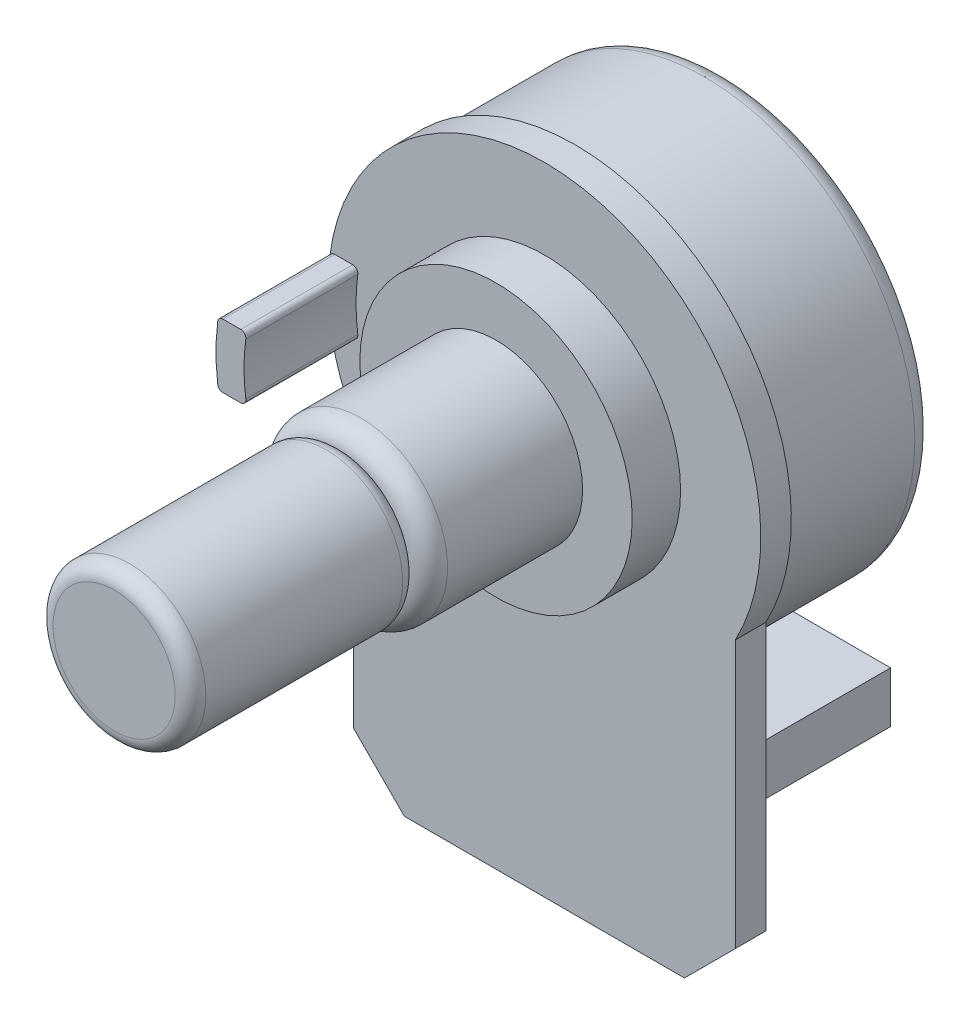
ISO-10303-21;
HEADER;
FILE_DESCRIPTION(('STEP AP214'),'2;1');
FILE_NAME('part.step','',(''),(''),'','','');
FILE_SCHEMA(('AUTOMOTIVE_DESIGN { 1 0 10303 214 1 1 1 1 }'));
ENDSEC;
DATA;
#1=APPLICATION_CONTEXT('core data for automotive mechanical design processes');
#2=APPLICATION_PROTOCOL_DEFINITION('international standard','automotive_design',2000,#1);
#3=PRODUCT_CONTEXT('',#1,'mechanical');
#4=PRODUCT('Part','Part','',(#3));
#5=PRODUCT_RELATED_PRODUCT_CATEGORY('part','',(#4));
#6=PRODUCT_DEFINITION_FORMATION('','',#4);
#7=PRODUCT_DEFINITION_CONTEXT('part definition',#1,'design');
#8=PRODUCT_DEFINITION('design','',#6,#7);
#9=PRODUCT_DEFINITION_SHAPE('','',#8);
#10=(LENGTH_UNIT() NAMED_UNIT(*) SI_UNIT(.MILLI.,.METRE.));
#11=(NAMED_UNIT(*) PLANE_ANGLE_UNIT() SI_UNIT($,.RADIAN.));
#12=(NAMED_UNIT(*) SI_UNIT($,.STERADIAN.) SOLID_ANGLE_UNIT());
#13=UNCERTAINTY_MEASURE_WITH_UNIT(LENGTH_MEASURE(1.E-05),#10,'distance_accuracy_value','');
#14=(GEOMETRIC_REPRESENTATION_CONTEXT(3) GLOBAL_UNCERTAINTY_ASSIGNED_CONTEXT((#13)) GLOBAL_UNIT_ASSIGNED_CONTEXT((#10,
#11,#12)) REPRESENTATION_CONTEXT('',''));
#15=CARTESIAN_POINT('',(0.,0.,0.));
#16=DIRECTION('',(0.,0.,1.));
#17=DIRECTION('',(1.,0.,0.));
#18=AXIS2_PLACEMENT_3D('',#15,#16,#17);
#19=CARTESIAN_POINT('',(0.,0.,1.2));
#20=DIRECTION('',(0.,0.,1.));
#21=DIRECTION('',(1.,0.,0.));
#22=AXIS2_PLACEMENT_3D('',#19,#20,#21);
#23=PLANE('',#22);
#24=CARTESIAN_POINT('',(0.,0.,1.2));
#25=DIRECTION('',(0.,0.,1.));
#26=DIRECTION('',(1.,0.,0.));
#27=AXIS2_PLACEMENT_3D('',#24,#25,#26);
#28=CIRCLE('',#27,5.35);
#29=CARTESIAN_POINT('',(-5.35,0.,1.2));
#30=VERTEX_POINT('',#29);
#31=EDGE_CURVE('E214',#30,#30,#28,.T.);
#32=ORIENTED_EDGE('',*,*,#31,.F.);
#33=EDGE_LOOP('',(#32));
#34=FACE_BOUND('',#33,.T.);
#35=CARTESIAN_POINT('',(1.70002900645727E-13,0.,1.2));
#36=DIRECTION('',(0.,0.,-1.));
#37=DIRECTION('',(1.,0.,0.));
#38=AXIS2_PLACEMENT_3D('',#35,#36,#37);
#39=CIRCLE('',#38,7.40000000000017);
#40=CARTESIAN_POINT('',(-7.32903559901536,-1.02236842105263,1.2));
#41=VERTEX_POINT('',#40);
#42=CARTESIAN_POINT('',(-7.32903559901535,1.02236842105263,1.2));
#43=VERTEX_POINT('',#42);
#44=EDGE_CURVE('E431',#41,#43,#39,.T.);
#45=ORIENTED_EDGE('',*,*,#44,.F.);
#46=CARTESIAN_POINT('',(-7.52711764223199,-1.05,1.2));
#47=DIRECTION('',(0.,0.,1.));
#48=DIRECTION('',(1.,0.,0.));
#49=AXIS2_PLACEMENT_3D('',#46,#47,#48);
#50=CIRCLE('',#49,0.2);
#51=CARTESIAN_POINT('',(-7.52711764223199,-1.25,1.2));
#52=VERTEX_POINT('',#51);
#53=EDGE_CURVE('E12',#41,#52,#50,.F.);
#54=ORIENTED_EDGE('',*,*,#53,.T.);
#55=DIRECTION('',(1.,0.,0.));
#56=VECTOR('',#55,1.);
#57=CARTESIAN_POINT('',(-8.40758586040012,-1.25,1.2));
#58=LINE('',#57,#56);
#59=CARTESIAN_POINT('',(-8.23331646422024,-1.25,1.2));
#60=VERTEX_POINT('',#59);
#61=EDGE_CURVE('E315',#60,#52,#58,.T.);
#62=ORIENTED_EDGE('',*,*,#61,.F.);
#63=CARTESIAN_POINT('',(-8.23331646422024,-1.05,1.2));
#64=DIRECTION('',(0.,0.,1.));
#65=DIRECTION('',(1.,0.,0.));
#66=AXIS2_PLACEMENT_3D('',#63,#64,#65);
#67=CIRCLE('',#66,0.2);
#68=CARTESIAN_POINT('',(-8.43170963203277,-1.07530120481928,1.2));
#69=VERTEX_POINT('',#68);
#70=EDGE_CURVE('E43',#60,#69,#67,.F.);
#71=ORIENTED_EDGE('',*,*,#70,.T.);
#72=CARTESIAN_POINT('',(0.,0.,1.2));
#73=DIRECTION('',(0.,0.,1.));
#74=DIRECTION('',(1.,0.,0.));
#75=AXIS2_PLACEMENT_3D('',#72,#73,#74);
#76=CIRCLE('',#75,8.5);
#77=CARTESIAN_POINT('',(-7.5,-4.,1.2));
#78=VERTEX_POINT('',#77);
#79=EDGE_CURVE('E225',#69,#78,#76,.T.);
#80=ORIENTED_EDGE('',*,*,#79,.T.);
#81=DIRECTION('',(0.,-1.,0.));
#82=VECTOR('',#81,1.);
#83=CARTESIAN_POINT('',(-7.5,-16.5,1.2));
#84=LINE('',#83,#82);
#85=CARTESIAN_POINT('',(-7.5,-14.5,1.2));
#86=VERTEX_POINT('',#85);
#87=EDGE_CURVE('E224',#78,#86,#84,.T.);
#88=ORIENTED_EDGE('',*,*,#87,.T.);
#89=DIRECTION('',(-0.707106781186547,0.707106781186548,0.));
#90=VECTOR('',#89,1.);
#91=CARTESIAN_POINT('',(-11.,-11.,1.2));
#92=LINE('',#91,#90);
#93=CARTESIAN_POINT('',(-5.5,-16.5,1.2));
#94=VERTEX_POINT('',#93);
#95=EDGE_CURVE('E278',#86,#94,#92,.F.);
#96=ORIENTED_EDGE('',*,*,#95,.T.);
#97=DIRECTION('',(1.,0.,0.));
#98=VECTOR('',#97,1.);
#99=CARTESIAN_POINT('',(7.5,-16.5,1.2));
#100=LINE('',#99,#98);
#101=CARTESIAN_POINT('',(5.49999999999999,-16.5,1.2));
#102=VERTEX_POINT('',#101);
#103=EDGE_CURVE('E228',#94,#102,#100,.T.);
#104=ORIENTED_EDGE('',*,*,#103,.T.);
#105=DIRECTION('',(-0.707106781186548,-0.707106781186547,0.));
#106=VECTOR('',#105,1.);
#107=CARTESIAN_POINT('',(11.,-11.,1.2));
#108=LINE('',#107,#106);
#109=CARTESIAN_POINT('',(7.5,-14.5,1.2));
#110=VERTEX_POINT('',#109);
#111=EDGE_CURVE('E280',#102,#110,#108,.F.);
#112=ORIENTED_EDGE('',*,*,#111,.T.);
#113=DIRECTION('',(0.,1.,0.));
#114=VECTOR('',#113,1.);
#115=CARTESIAN_POINT('',(7.5,-4.,1.2));
#116=LINE('',#115,#114);
#117=CARTESIAN_POINT('',(7.5,-4.,1.2));
#118=VERTEX_POINT('',#117);
#119=EDGE_CURVE('E231',#110,#118,#116,.T.);
#120=ORIENTED_EDGE('',*,*,#119,.T.);
#121=CARTESIAN_POINT('',(-8.43170963203277,1.07530120481928,1.2));
#122=VERTEX_POINT('',#121);
#123=EDGE_CURVE('E222',#118,#122,#76,.T.);
#124=ORIENTED_EDGE('',*,*,#123,.T.);
#125=CARTESIAN_POINT('',(-8.23331646422024,1.05,1.2));
#126=DIRECTION('',(0.,0.,1.));
#127=DIRECTION('',(1.,0.,0.));
#128=AXIS2_PLACEMENT_3D('',#125,#126,#127);
#129=CIRCLE('',#128,0.2);
#130=CARTESIAN_POINT('',(-8.23331646422024,1.25,1.2));
#131=VERTEX_POINT('',#130);
#132=EDGE_CURVE('E313',#122,#131,#129,.F.);
#133=ORIENTED_EDGE('',*,*,#132,.T.);
#134=DIRECTION('',(-1.,0.,0.));
#135=VECTOR('',#134,1.);
#136=CARTESIAN_POINT('',(-8.40758586040012,1.25,1.2));
#137=LINE('',#136,#135);
#138=CARTESIAN_POINT('',(-7.52711764223198,1.25,1.2));
#139=VERTEX_POINT('',#138);
#140=EDGE_CURVE('E334',#139,#131,#137,.T.);
#141=ORIENTED_EDGE('',*,*,#140,.F.);
#142=CARTESIAN_POINT('',(-7.52711764223198,1.05,1.2));
#143=DIRECTION('',(0.,0.,1.));
#144=DIRECTION('',(1.,0.,0.));
#145=AXIS2_PLACEMENT_3D('',#142,#143,#144);
#146=CIRCLE('',#145,0.2);
#147=EDGE_CURVE('E311',#139,#43,#146,.F.);
#148=ORIENTED_EDGE('',*,*,#147,.T.);
#149=EDGE_LOOP('',(#45,#54,#62,#71,#80,#88,#96,#104,#112,#120,#124,#133,#141,#148));
#150=FACE_BOUND('',#149,.T.);
#151=ADVANCED_FACE('F35',(#34,#150),#23,.T.);
#152=CARTESIAN_POINT('',(0.,0.,0.));
#153=DIRECTION('',(0.,0.,1.));
#154=DIRECTION('',(1.,0.,0.));
#155=AXIS2_PLACEMENT_3D('',#152,#153,#154);
#156=PLANE('',#155);
#157=DIRECTION('',(0.,1.,0.));
#158=VECTOR('',#157,1.);
#159=CARTESIAN_POINT('',(7.5,-4.,0.));
#160=LINE('',#159,#158);
#161=CARTESIAN_POINT('',(7.5,-14.5,0.));
#162=VERTEX_POINT('',#161);
#163=CARTESIAN_POINT('',(7.5,-4.,0.));
#164=VERTEX_POINT('',#163);
#165=EDGE_CURVE('E242',#162,#164,#160,.T.);
#166=ORIENTED_EDGE('',*,*,#165,.F.);
#167=DIRECTION('',(0.707106781186548,0.707106781186547,0.));
#168=VECTOR('',#167,1.);
#169=CARTESIAN_POINT('',(7.5,-14.5,0.));
#170=LINE('',#169,#168);
#171=CARTESIAN_POINT('',(5.49999999999999,-16.5,0.));
#172=VERTEX_POINT('',#171);
#173=EDGE_CURVE('E271',#162,#172,#170,.F.);
#174=ORIENTED_EDGE('',*,*,#173,.T.);
#175=DIRECTION('',(1.,0.,0.));
#176=VECTOR('',#175,1.);
#177=CARTESIAN_POINT('',(7.5,-16.5,0.));
#178=LINE('',#177,#176);
#179=CARTESIAN_POINT('',(-5.5,-16.5,0.));
#180=VERTEX_POINT('',#179);
#181=EDGE_CURVE('E239',#180,#172,#178,.T.);
#182=ORIENTED_EDGE('',*,*,#181,.F.);
#183=DIRECTION('',(0.707106781186547,-0.707106781186548,0.));
#184=VECTOR('',#183,1.);
#185=CARTESIAN_POINT('',(-5.5,-16.5,0.));
#186=LINE('',#185,#184);
#187=CARTESIAN_POINT('',(-7.5,-14.5,0.));
#188=VERTEX_POINT('',#187);
#189=EDGE_CURVE('E269',#180,#188,#186,.F.);
#190=ORIENTED_EDGE('',*,*,#189,.T.);
#191=DIRECTION('',(0.,-1.,0.));
#192=VECTOR('',#191,1.);
#193=CARTESIAN_POINT('',(-7.5,-16.5,0.));
#194=LINE('',#193,#192);
#195=CARTESIAN_POINT('',(-7.5,-4.,0.));
#196=VERTEX_POINT('',#195);
#197=EDGE_CURVE('E236',#196,#188,#194,.T.);
#198=ORIENTED_EDGE('',*,*,#197,.F.);
#199=CARTESIAN_POINT('',(0.,0.,0.));
#200=DIRECTION('',(0.,0.,1.));
#201=DIRECTION('',(1.,0.,0.));
#202=AXIS2_PLACEMENT_3D('',#199,#200,#201);
#203=CIRCLE('',#202,8.5);
#204=EDGE_CURVE('E218',#164,#196,#203,.T.);
#205=ORIENTED_EDGE('',*,*,#204,.F.);
#206=EDGE_LOOP('',(#166,#174,#182,#190,#198,#205));
#207=FACE_BOUND('',#206,.T.);
#208=CARTESIAN_POINT('',(0.,0.,0.));
#209=DIRECTION('',(0.,0.,-1.));
#210=DIRECTION('',(-1.,0.,0.));
#211=AXIS2_PLACEMENT_3D('',#208,#209,#210);
#212=CIRCLE('',#211,8.25);
#213=CARTESIAN_POINT('',(-8.25,0.,0.));
#214=VERTEX_POINT('',#213);
#215=EDGE_CURVE('E205',#214,#214,#212,.T.);
#216=ORIENTED_EDGE('',*,*,#215,.F.);
#217=EDGE_LOOP('',(#216));
#218=FACE_BOUND('',#217,.T.);
#219=DIRECTION('',(1.,0.,0.));
#220=VECTOR('',#219,1.);
#221=CARTESIAN_POINT('',(6.49799227004166,-9.,0.));
#222=LINE('',#221,#220);
#223=CARTESIAN_POINT('',(-6.49799227004166,-9.,0.));
#224=VERTEX_POINT('',#223);
#225=CARTESIAN_POINT('',(6.49799227004166,-9.,0.));
#226=VERTEX_POINT('',#225);
#227=EDGE_CURVE('E195',#224,#226,#222,.T.);
#228=ORIENTED_EDGE('',*,*,#227,.F.);
#229=DIRECTION('',(0.,1.,0.));
#230=VECTOR('',#229,1.);
#231=CARTESIAN_POINT('',(-6.49799227004166,-9.,0.));
#232=LINE('',#231,#230);
#233=CARTESIAN_POINT('',(-6.49799227004166,-11.,0.));
#234=VERTEX_POINT('',#233);
#235=EDGE_CURVE('E166',#234,#224,#232,.T.);
#236=ORIENTED_EDGE('',*,*,#235,.F.);
#237=DIRECTION('',(-1.,0.,0.));
#238=VECTOR('',#237,1.);
#239=CARTESIAN_POINT('',(6.49799227004166,-11.,0.));
#240=LINE('',#239,#238);
#241=CARTESIAN_POINT('',(6.49799227004166,-11.,0.));
#242=VERTEX_POINT('',#241);
#243=EDGE_CURVE('E159',#242,#234,#240,.T.);
#244=ORIENTED_EDGE('',*,*,#243,.F.);
#245=DIRECTION('',(0.,-1.,0.));
#246=VECTOR('',#245,1.);
#247=CARTESIAN_POINT('',(6.49799227004166,-9.,0.));
#248=LINE('',#247,#246);
#249=EDGE_CURVE('E163',#226,#242,#248,.T.);
#250=ORIENTED_EDGE('',*,*,#249,.F.);
#251=EDGE_LOOP('',(#228,#236,#244,#250));
#252=FACE_BOUND('',#251,.T.);
#253=ADVANCED_FACE('F161',(#207,#218,#252),#156,.F.);
#254=CARTESIAN_POINT('',(0.,0.,1.2));
#255=DIRECTION('',(0.,0.,-1.));
#256=DIRECTION('',(-1.,0.,0.));
#257=AXIS2_PLACEMENT_3D('',#254,#255,#256);
#258=CYLINDRICAL_SURFACE('',#257,8.5);
#259=CARTESIAN_POINT('',(1.70002900645727E-13,0.,5.6));
#260=DIRECTION('',(0.,0.,1.));
#261=DIRECTION('',(1.,0.,0.));
#262=AXIS2_PLACEMENT_3D('',#259,#260,#261);
#263=CIRCLE('',#262,8.50000000000017);
#264=CARTESIAN_POINT('',(-8.43170963203277,1.07530120481928,5.6));
#265=VERTEX_POINT('',#264);
#266=CARTESIAN_POINT('',(-8.43170963203277,-1.07530120481928,5.6));
#267=VERTEX_POINT('',#266);
#268=EDGE_CURVE('E322',#265,#267,#263,.T.);
#269=ORIENTED_EDGE('',*,*,#268,.F.);
#270=DIRECTION('',(0.,0.,-1.));
#271=VECTOR('',#270,1.);
#272=CARTESIAN_POINT('',(-8.43170963203277,1.07530120481928,1.2));
#273=LINE('',#272,#271);
#274=EDGE_CURVE('E304',#265,#122,#273,.T.);
#275=ORIENTED_EDGE('',*,*,#274,.T.);
#276=ORIENTED_EDGE('',*,*,#123,.F.);
#277=DIRECTION('',(0.,0.,-1.));
#278=VECTOR('',#277,1.);
#279=CARTESIAN_POINT('',(7.5,-4.,1.2));
#280=LINE('',#279,#278);
#281=EDGE_CURVE('E233',#118,#164,#280,.T.);
#282=ORIENTED_EDGE('',*,*,#281,.T.);
#283=ORIENTED_EDGE('',*,*,#204,.T.);
#284=DIRECTION('',(0.,0.,-1.));
#285=VECTOR('',#284,1.);
#286=CARTESIAN_POINT('',(-7.5,-4.,1.2));
#287=LINE('',#286,#285);
#288=EDGE_CURVE('E221',#78,#196,#287,.T.);
#289=ORIENTED_EDGE('',*,*,#288,.F.);
#290=ORIENTED_EDGE('',*,*,#79,.F.);
#291=DIRECTION('',(0.,0.,-1.));
#292=VECTOR('',#291,1.);
#293=CARTESIAN_POINT('',(-8.43170963203277,-1.07530120481928,1.2));
#294=LINE('',#293,#292);
#295=EDGE_CURVE('E302',#69,#267,#294,.F.);
#296=ORIENTED_EDGE('',*,*,#295,.T.);
#297=EDGE_LOOP('',(#269,#275,#276,#282,#283,#289,#290,#296));
#298=FACE_BOUND('',#297,.T.);
#299=ADVANCED_FACE('F321',(#298),#258,.T.);
#300=CARTESIAN_POINT('',(-7.5,-16.5,1.2));
#301=DIRECTION('',(1.,0.,0.));
#302=DIRECTION('',(0.,0.,-1.));
#303=AXIS2_PLACEMENT_3D('',#300,#301,#302);
#304=PLANE('',#303);
#305=ORIENTED_EDGE('',*,*,#197,.T.);
#306=DIRECTION('',(0.,0.,1.));
#307=VECTOR('',#306,1.);
#308=CARTESIAN_POINT('',(-7.5,-14.5,1.2));
#309=LINE('',#308,#307);
#310=EDGE_CURVE('E282',#188,#86,#309,.T.);
#311=ORIENTED_EDGE('',*,*,#310,.T.);
#312=ORIENTED_EDGE('',*,*,#87,.F.);
#313=ORIENTED_EDGE('',*,*,#288,.T.);
#314=EDGE_LOOP('',(#305,#311,#312,#313));
#315=FACE_BOUND('',#314,.T.);
#316=ADVANCED_FACE('F378',(#315),#304,.F.);
#317=CARTESIAN_POINT('',(7.5,-16.5,1.2));
#318=DIRECTION('',(0.,1.,0.));
#319=DIRECTION('',(0.,0.,1.));
#320=AXIS2_PLACEMENT_3D('',#317,#318,#319);
#321=PLANE('',#320);
#322=ORIENTED_EDGE('',*,*,#181,.T.);
#323=DIRECTION('',(0.,0.,1.));
#324=VECTOR('',#323,1.);
#325=CARTESIAN_POINT('',(5.49999999999999,-16.5,1.2));
#326=LINE('',#325,#324);
#327=EDGE_CURVE('E276',#172,#102,#326,.T.);
#328=ORIENTED_EDGE('',*,*,#327,.T.);
#329=ORIENTED_EDGE('',*,*,#103,.F.);
#330=DIRECTION('',(0.,0.,-1.));
#331=VECTOR('',#330,1.);
#332=CARTESIAN_POINT('',(-5.5,-16.5,1.2));
#333=LINE('',#332,#331);
#334=EDGE_CURVE('E273',#94,#180,#333,.T.);
#335=ORIENTED_EDGE('',*,*,#334,.T.);
#336=EDGE_LOOP('',(#322,#328,#329,#335));
#337=FACE_BOUND('',#336,.T.);
#338=ADVANCED_FACE('F374',(#337),#321,.F.);
#339=CARTESIAN_POINT('',(7.5,-4.,1.2));
#340=DIRECTION('',(-1.,0.,0.));
#341=DIRECTION('',(0.,0.,1.));
#342=AXIS2_PLACEMENT_3D('',#339,#340,#341);
#343=PLANE('',#342);
#344=ORIENTED_EDGE('',*,*,#119,.F.);
#345=DIRECTION('',(0.,0.,-1.));
#346=VECTOR('',#345,1.);
#347=CARTESIAN_POINT('',(7.5,-14.5,1.2));
#348=LINE('',#347,#346);
#349=EDGE_CURVE('E266',#110,#162,#348,.T.);
#350=ORIENTED_EDGE('',*,*,#349,.T.);
#351=ORIENTED_EDGE('',*,*,#165,.T.);
#352=ORIENTED_EDGE('',*,*,#281,.F.);
#353=EDGE_LOOP('',(#344,#350,#351,#352));
#354=FACE_BOUND('',#353,.T.);
#355=ADVANCED_FACE('F371',(#354),#343,.F.);
#356=CARTESIAN_POINT('',(0.,0.,3.1));
#357=DIRECTION('',(0.,0.,-1.));
#358=DIRECTION('',(-1.,0.,0.));
#359=AXIS2_PLACEMENT_3D('',#356,#357,#358);
#360=CYLINDRICAL_SURFACE('',#359,5.35);
#361=CARTESIAN_POINT('',(0.,0.,3.1));
#362=DIRECTION('',(0.,0.,1.));
#363=DIRECTION('',(1.,0.,0.));
#364=AXIS2_PLACEMENT_3D('',#361,#362,#363);
#365=CIRCLE('',#364,5.35);
#366=CARTESIAN_POINT('',(-5.35,0.,3.1));
#367=VERTEX_POINT('',#366);
#368=EDGE_CURVE('E215',#367,#367,#365,.T.);
#369=CARTESIAN_POINT('',(-5.35,0.,3.1));
#370=CARTESIAN_POINT('',(-5.35,0.,3.08020833333333));
#371=CARTESIAN_POINT('',(-5.35,0.,3.06041666666667));
#372=CARTESIAN_POINT('',(-5.35,0.,3.02083333333333));
#373=CARTESIAN_POINT('',(-5.35,0.,3.00104166666667));
#374=CARTESIAN_POINT('',(-5.35,0.,2.96145833333333));
#375=CARTESIAN_POINT('',(-5.35,0.,2.94166666666667));
#376=CARTESIAN_POINT('',(-5.35,0.,2.90208333333333));
#377=CARTESIAN_POINT('',(-5.35,0.,2.88229166666667));
#378=CARTESIAN_POINT('',(-5.35,0.,2.84270833333333));
#379=CARTESIAN_POINT('',(-5.35,0.,2.82291666666667));
#380=CARTESIAN_POINT('',(-5.35,0.,2.78333333333333));
#381=CARTESIAN_POINT('',(-5.35,0.,2.76354166666667));
#382=CARTESIAN_POINT('',(-5.35,0.,2.72395833333333));
#383=CARTESIAN_POINT('',(-5.35,0.,2.70416666666667));
#384=CARTESIAN_POINT('',(-5.35,0.,2.66458333333333));
#385=CARTESIAN_POINT('',(-5.35,0.,2.64479166666667));
#386=CARTESIAN_POINT('',(-5.35,0.,2.60520833333333));
#387=CARTESIAN_POINT('',(-5.35,0.,2.58541666666667));
#388=CARTESIAN_POINT('',(-5.35,0.,2.54583333333333));
#389=CARTESIAN_POINT('',(-5.35,0.,2.52604166666667));
#390=CARTESIAN_POINT('',(-5.35,0.,2.48645833333333));
#391=CARTESIAN_POINT('',(-5.35,0.,2.46666666666667));
#392=CARTESIAN_POINT('',(-5.35,0.,2.42708333333333));
#393=CARTESIAN_POINT('',(-5.35,0.,2.40729166666667));
#394=CARTESIAN_POINT('',(-5.35,0.,2.36770833333333));
#395=CARTESIAN_POINT('',(-5.35,0.,2.34791666666667));
#396=CARTESIAN_POINT('',(-5.35,0.,2.30833333333333));
#397=CARTESIAN_POINT('',(-5.35,0.,2.28854166666667));
#398=CARTESIAN_POINT('',(-5.35,0.,2.24895833333333));
#399=CARTESIAN_POINT('',(-5.35,0.,2.22916666666667));
#400=CARTESIAN_POINT('',(-5.35,0.,2.18958333333333));
#401=CARTESIAN_POINT('',(-5.35,0.,2.16979166666667));
#402=CARTESIAN_POINT('',(-5.35,0.,2.13020833333333));
#403=CARTESIAN_POINT('',(-5.35,0.,2.11041666666667));
#404=CARTESIAN_POINT('',(-5.35,0.,2.07083333333333));
#405=CARTESIAN_POINT('',(-5.35,0.,2.05104166666667));
#406=CARTESIAN_POINT('',(-5.35,0.,2.01145833333333));
#407=CARTESIAN_POINT('',(-5.35,0.,1.99166666666667));
#408=CARTESIAN_POINT('',(-5.35,0.,1.95208333333333));
#409=CARTESIAN_POINT('',(-5.35,0.,1.93229166666667));
#410=CARTESIAN_POINT('',(-5.35,0.,1.89270833333333));
#411=CARTESIAN_POINT('',(-5.35,0.,1.87291666666667));
#412=CARTESIAN_POINT('',(-5.35,0.,1.83333333333333));
#413=CARTESIAN_POINT('',(-5.35,0.,1.81354166666667));
#414=CARTESIAN_POINT('',(-5.35,0.,1.77395833333333));
#415=CARTESIAN_POINT('',(-5.35,0.,1.75416666666667));
#416=CARTESIAN_POINT('',(-5.35,0.,1.71458333333333));
#417=CARTESIAN_POINT('',(-5.35,0.,1.69479166666667));
#418=CARTESIAN_POINT('',(-5.35,0.,1.65520833333333));
#419=CARTESIAN_POINT('',(-5.35,0.,1.63541666666667));
#420=CARTESIAN_POINT('',(-5.35,0.,1.59583333333333));
#421=CARTESIAN_POINT('',(-5.35,0.,1.57604166666667));
#422=CARTESIAN_POINT('',(-5.35,0.,1.53645833333333));
#423=CARTESIAN_POINT('',(-5.35,0.,1.51666666666667));
#424=CARTESIAN_POINT('',(-5.35,0.,1.47708333333333));
#425=CARTESIAN_POINT('',(-5.35,0.,1.45729166666667));
#426=CARTESIAN_POINT('',(-5.35,0.,1.41770833333333));
#427=CARTESIAN_POINT('',(-5.35,0.,1.39791666666667));
#428=CARTESIAN_POINT('',(-5.35,0.,1.35833333333333));
#429=CARTESIAN_POINT('',(-5.35,0.,1.33854166666667));
#430=CARTESIAN_POINT('',(-5.35,0.,1.29895833333333));
#431=CARTESIAN_POINT('',(-5.35,0.,1.27916666666667));
#432=CARTESIAN_POINT('',(-5.35,0.,1.23958333333333));
#433=CARTESIAN_POINT('',(-5.35,0.,1.21979166666667));
#434=CARTESIAN_POINT('',(-5.35,0.,1.2));
#435=B_SPLINE_CURVE_WITH_KNOTS('',3,(#369,#370,#371,#372,#373,#374,#375,#376,#377,#378,#379,
#380,#381,#382,#383,#384,#385,#386,#387,#388,#389,#390,#391,#392,#393,#394,#395,#396,#397,#398,
#399,#400,#401,#402,#403,#404,#405,#406,#407,#408,#409,#410,#411,#412,#413,#414,#415,#416,#417,
#418,#419,#420,#421,#422,#423,#424,#425,#426,#427,#428,#429,#430,#431,#432,#433,#434),
.UNSPECIFIED.,.F.,.F.,(4,2,2,2,2,2,2,2,2,2,2,2,2,2,2,2,2,2,2,2,2,2,2,2,2,2,2,2,2,2,2,2,4),(0.,
0.0593750000000004,0.11875,0.178125,0.2375,0.296875,0.35625,0.415625,0.475,0.534375,0.59375,
0.653125,0.7125,0.771875,0.83125,0.890625,0.95,1.009375,1.06875,1.128125,1.1875,1.246875,
1.30625,1.365625,1.425,1.484375,1.54375,1.603125,1.6625,1.721875,1.78125,1.840625,1.9),.UNSPECIFIED.);
#436=EDGE_CURVE('BSEAM368',#367,#30,#435,.T.);
#437=ORIENTED_EDGE('',*,*,#368,.F.);
#438=ORIENTED_EDGE('',*,*,#31,.T.);
#439=ORIENTED_EDGE('',*,*,#436,.T.);
#440=ORIENTED_EDGE('',*,*,#436,.F.);
#441=EDGE_LOOP('',(#437,#439,#438,#440));
#442=FACE_BOUND('',#441,.T.);
#443=ADVANCED_FACE('F368',(#442),#360,.T.);
#444=CARTESIAN_POINT('',(0.,0.,3.1));
#445=DIRECTION('',(0.,0.,1.));
#446=DIRECTION('',(1.,0.,0.));
#447=AXIS2_PLACEMENT_3D('',#444,#445,#446);
#448=PLANE('',#447);
#449=CARTESIAN_POINT('',(0.,0.,3.1));
#450=DIRECTION('',(0.,0.,1.));
#451=DIRECTION('',(1.,0.,0.));
#452=AXIS2_PLACEMENT_3D('',#449,#450,#451);
#453=CIRCLE('',#452,3.4);
#454=CARTESIAN_POINT('',(3.4,0.,3.1));
#455=VERTEX_POINT('',#454);
#456=EDGE_CURVE('E210',#455,#455,#453,.T.);
#457=ORIENTED_EDGE('',*,*,#456,.F.);
#458=EDGE_LOOP('',(#457));
#459=FACE_BOUND('',#458,.T.);
#460=ORIENTED_EDGE('',*,*,#368,.T.);
#461=EDGE_LOOP('',(#460));
#462=FACE_BOUND('',#461,.T.);
#463=ADVANCED_FACE('F474',(#459,#462),#448,.T.);
#464=CARTESIAN_POINT('',(0.,0.,9.2));
#465=DIRECTION('',(0.,0.,-1.));
#466=DIRECTION('',(-1.,0.,0.));
#467=AXIS2_PLACEMENT_3D('',#464,#465,#466);
#468=CYLINDRICAL_SURFACE('',#467,3.4);
#469=CARTESIAN_POINT('',(0.,0.,8.4));
#470=DIRECTION('',(0.,0.,1.));
#471=DIRECTION('',(1.,0.,0.));
#472=AXIS2_PLACEMENT_3D('',#469,#470,#471);
#473=CIRCLE('',#472,3.4);
#474=CARTESIAN_POINT('',(3.4,0.,8.4));
#475=VERTEX_POINT('',#474);
#476=EDGE_CURVE('E209',#475,#475,#473,.F.);
#477=ORIENTED_EDGE('',*,*,#476,.T.);
#478=EDGE_LOOP('',(#477));
#479=FACE_BOUND('',#478,.T.);
#480=ORIENTED_EDGE('',*,*,#456,.T.);
#481=EDGE_LOOP('',(#480));
#482=FACE_BOUND('',#481,.T.);
#483=ADVANCED_FACE('F389',(#479,#482),#468,.T.);
#484=CARTESIAN_POINT('',(0.,0.,8.4));
#485=DIRECTION('',(0.,0.,1.));
#486=DIRECTION('',(1.,0.,0.));
#487=AXIS2_PLACEMENT_3D('',#484,#485,#486);
#488=TOROIDAL_SURFACE('',#487,2.6,0.8);
#489=ORIENTED_EDGE('',*,*,#476,.F.);
#490=EDGE_LOOP('',(#489));
#491=FACE_BOUND('',#490,.T.);
#492=CARTESIAN_POINT('',(0.,0.,9.2));
#493=DIRECTION('',(0.,0.,1.));
#494=DIRECTION('',(1.,0.,0.));
#495=AXIS2_PLACEMENT_3D('',#492,#493,#494);
#496=CIRCLE('',#495,2.6);
#497=CARTESIAN_POINT('',(2.6,0.,9.2));
#498=VERTEX_POINT('',#497);
#499=EDGE_CURVE('E213',#498,#498,#496,.T.);
#500=ORIENTED_EDGE('',*,*,#499,.F.);
#501=EDGE_LOOP('',(#500));
#502=FACE_BOUND('',#501,.T.);
#503=ADVANCED_FACE('F385',(#491,#502),#488,.T.);
#504=CARTESIAN_POINT('',(0.,0.,41.5852813742386));
#505=DIRECTION('',(0.,0.,-1.));
#506=DIRECTION('',(-1.,0.,0.));
#507=AXIS2_PLACEMENT_3D('',#504,#505,#506);
#508=CYLINDRICAL_SURFACE('',#507,3.);
#509=CARTESIAN_POINT('',(0.,0.,17.5));
#510=DIRECTION('',(0.,0.,1.));
#511=DIRECTION('',(1.,0.,0.));
#512=AXIS2_PLACEMENT_3D('',#509,#510,#511);
#513=CIRCLE('',#512,3.);
#514=CARTESIAN_POINT('',(3.,0.,17.5));
#515=VERTEX_POINT('',#514);
#516=EDGE_CURVE('E263',#515,#515,#513,.F.);
#517=ORIENTED_EDGE('',*,*,#516,.T.);
#518=EDGE_LOOP('',(#517));
#519=FACE_BOUND('',#518,.T.);
#520=CARTESIAN_POINT('',(0.,0.,9.76568542494924));
#521=DIRECTION('',(0.,0.,-1.));
#522=DIRECTION('',(-1.,0.,0.));
#523=AXIS2_PLACEMENT_3D('',#520,#521,#522);
#524=CIRCLE('',#523,3.);
#525=CARTESIAN_POINT('',(-3.,0.,9.76568542494924));
#526=VERTEX_POINT('',#525);
#527=EDGE_CURVE('E260',#526,#526,#524,.F.);
#528=ORIENTED_EDGE('',*,*,#527,.T.);
#529=EDGE_LOOP('',(#528));
#530=FACE_BOUND('',#529,.T.);
#531=ADVANCED_FACE('F388',(#519,#530),#508,.T.);
#532=CARTESIAN_POINT('',(0.,0.,18.1));
#533=DIRECTION('',(0.,0.,1.));
#534=DIRECTION('',(1.,0.,0.));
#535=AXIS2_PLACEMENT_3D('',#532,#533,#534);
#536=PLANE('',#535);
#537=CARTESIAN_POINT('',(0.,0.,18.1));
#538=DIRECTION('',(0.,0.,1.));
#539=DIRECTION('',(1.,0.,0.));
#540=AXIS2_PLACEMENT_3D('',#537,#538,#539);
#541=CIRCLE('',#540,2.4);
#542=CARTESIAN_POINT('',(2.4,0.,18.1));
#543=VERTEX_POINT('',#542);
#544=EDGE_CURVE('E257',#543,#543,#541,.T.);
#545=ORIENTED_EDGE('',*,*,#544,.T.);
#546=EDGE_LOOP('',(#545));
#547=FACE_BOUND('',#546,.T.);
#548=ADVANCED_FACE('F458',(#547),#536,.T.);
#549=CARTESIAN_POINT('',(0.,0.,-38.2345237791561));
#550=DIRECTION('',(0.,0.,1.));
#551=DIRECTION('',(1.,0.,0.));
#552=AXIS2_PLACEMENT_3D('',#549,#550,#551);
#553=CYLINDRICAL_SURFACE('',#552,8.25);
#554=CARTESIAN_POINT('',(0.,0.,-5.1));
#555=DIRECTION('',(0.,0.,1.));
#556=DIRECTION('',(1.,0.,0.));
#557=AXIS2_PLACEMENT_3D('',#554,#555,#556);
#558=CIRCLE('',#557,8.25);
#559=CARTESIAN_POINT('',(8.25,0.,-5.1));
#560=VERTEX_POINT('',#559);
#561=EDGE_CURVE('E208',#560,#560,#558,.T.);
#562=ORIENTED_EDGE('',*,*,#561,.T.);
#563=EDGE_LOOP('',(#562));
#564=FACE_BOUND('',#563,.T.);
#565=ORIENTED_EDGE('',*,*,#215,.T.);
#566=EDGE_LOOP('',(#565));
#567=FACE_BOUND('',#566,.T.);
#568=ADVANCED_FACE('F456',(#564,#567),#553,.T.);
#569=CARTESIAN_POINT('',(0.,0.,-5.9));
#570=DIRECTION('',(0.,0.,1.));
#571=DIRECTION('',(1.,0.,0.));
#572=AXIS2_PLACEMENT_3D('',#569,#570,#571);
#573=PLANE('',#572);
#574=CARTESIAN_POINT('',(0.,0.,-5.9));
#575=DIRECTION('',(0.,0.,1.));
#576=DIRECTION('',(1.,0.,0.));
#577=AXIS2_PLACEMENT_3D('',#574,#575,#576);
#578=CIRCLE('',#577,7.45);
#579=CARTESIAN_POINT('',(7.45,0.,-5.9));
#580=VERTEX_POINT('',#579);
#581=EDGE_CURVE('E254',#580,#580,#578,.F.);
#582=ORIENTED_EDGE('',*,*,#581,.T.);
#583=EDGE_LOOP('',(#582));
#584=FACE_BOUND('',#583,.T.);
#585=ADVANCED_FACE('F393',(#584),#573,.F.);
#586=CARTESIAN_POINT('',(0.,0.,-5.1));
#587=DIRECTION('',(0.,0.,1.));
#588=DIRECTION('',(1.,0.,0.));
#589=AXIS2_PLACEMENT_3D('',#586,#587,#588);
#590=TOROIDAL_SURFACE('',#589,7.45,0.8);
#591=ORIENTED_EDGE('',*,*,#581,.F.);
#592=EDGE_LOOP('',(#591));
#593=FACE_BOUND('',#592,.T.);
#594=ORIENTED_EDGE('',*,*,#561,.F.);
#595=EDGE_LOOP('',(#594));
#596=FACE_BOUND('',#595,.T.);
#597=ADVANCED_FACE('F391',(#593,#596),#590,.T.);
#598=CARTESIAN_POINT('',(6.49799227004166,-9.,-19.0489776852075));
#599=DIRECTION('',(0.,-1.,0.));
#600=DIRECTION('',(0.,0.,-1.));
#601=AXIS2_PLACEMENT_3D('',#598,#599,#600);
#602=PLANE('',#601);
#603=DIRECTION('',(0.,0.,1.));
#604=VECTOR('',#603,1.);
#605=CARTESIAN_POINT('',(6.49799227004166,-9.,-19.0489776852075));
#606=LINE('',#605,#604);
#607=CARTESIAN_POINT('',(6.49799227004166,-9.,-5.9));
#608=VERTEX_POINT('',#607);
#609=EDGE_CURVE('E183',#608,#226,#606,.T.);
#610=ORIENTED_EDGE('',*,*,#609,.F.);
#611=DIRECTION('',(-1.,0.,0.));
#612=VECTOR('',#611,1.);
#613=CARTESIAN_POINT('',(6.49799227004166,-9.,-5.9));
#614=LINE('',#613,#612);
#615=CARTESIAN_POINT('',(-6.49799227004166,-9.,-5.9));
#616=VERTEX_POINT('',#615);
#617=EDGE_CURVE('E178',#608,#616,#614,.T.);
#618=ORIENTED_EDGE('',*,*,#617,.T.);
#619=DIRECTION('',(0.,0.,1.));
#620=VECTOR('',#619,1.);
#621=CARTESIAN_POINT('',(-6.49799227004166,-9.,-19.0489776852075));
#622=LINE('',#621,#620);
#623=EDGE_CURVE('E198',#616,#224,#622,.T.);
#624=ORIENTED_EDGE('',*,*,#623,.T.);
#625=ORIENTED_EDGE('',*,*,#227,.T.);
#626=EDGE_LOOP('',(#610,#618,#624,#625));
#627=FACE_BOUND('',#626,.T.);
#628=ADVANCED_FACE('F340',(#627),#602,.F.);
#629=CARTESIAN_POINT('',(-6.49799227004166,-9.,-19.0489776852075));
#630=DIRECTION('',(1.,0.,0.));
#631=DIRECTION('',(0.,0.,-1.));
#632=AXIS2_PLACEMENT_3D('',#629,#630,#631);
#633=PLANE('',#632);
#634=ORIENTED_EDGE('',*,*,#623,.F.);
#635=DIRECTION('',(0.,-1.,0.));
#636=VECTOR('',#635,1.);
#637=CARTESIAN_POINT('',(-6.49799227004166,-9.,-5.9));
#638=LINE('',#637,#636);
#639=CARTESIAN_POINT('',(-6.49799227004166,-11.,-5.9));
#640=VERTEX_POINT('',#639);
#641=EDGE_CURVE('E204',#616,#640,#638,.T.);
#642=ORIENTED_EDGE('',*,*,#641,.T.);
#643=DIRECTION('',(0.,0.,1.));
#644=VECTOR('',#643,1.);
#645=CARTESIAN_POINT('',(-6.49799227004166,-11.,-19.0489776852075));
#646=LINE('',#645,#644);
#647=EDGE_CURVE('E179',#640,#234,#646,.T.);
#648=ORIENTED_EDGE('',*,*,#647,.T.);
#649=ORIENTED_EDGE('',*,*,#235,.T.);
#650=EDGE_LOOP('',(#634,#642,#648,#649));
#651=FACE_BOUND('',#650,.T.);
#652=ADVANCED_FACE('F343',(#651),#633,.F.);
#653=CARTESIAN_POINT('',(6.49799227004166,-11.,-19.0489776852075));
#654=DIRECTION('',(0.,1.,0.));
#655=DIRECTION('',(0.,0.,1.));
#656=AXIS2_PLACEMENT_3D('',#653,#654,#655);
#657=PLANE('',#656);
#658=ORIENTED_EDGE('',*,*,#647,.F.);
#659=DIRECTION('',(1.,0.,0.));
#660=VECTOR('',#659,1.);
#661=CARTESIAN_POINT('',(6.49799227004166,-11.,-5.9));
#662=LINE('',#661,#660);
#663=CARTESIAN_POINT('',(6.49799227004166,-11.,-5.9));
#664=VERTEX_POINT('',#663);
#665=EDGE_CURVE('E175',#640,#664,#662,.T.);
#666=ORIENTED_EDGE('',*,*,#665,.T.);
#667=DIRECTION('',(0.,0.,1.));
#668=VECTOR('',#667,1.);
#669=CARTESIAN_POINT('',(6.49799227004166,-11.,-19.0489776852075));
#670=LINE('',#669,#668);
#671=EDGE_CURVE('E173',#664,#242,#670,.T.);
#672=ORIENTED_EDGE('',*,*,#671,.T.);
#673=ORIENTED_EDGE('',*,*,#243,.T.);
#674=EDGE_LOOP('',(#658,#666,#672,#673));
#675=FACE_BOUND('',#674,.T.);
#676=ADVANCED_FACE('F174',(#675),#657,.F.);
#677=CARTESIAN_POINT('',(6.49799227004166,-9.,-19.0489776852075));
#678=DIRECTION('',(-1.,0.,0.));
#679=DIRECTION('',(0.,0.,1.));
#680=AXIS2_PLACEMENT_3D('',#677,#678,#679);
#681=PLANE('',#680);
#682=ORIENTED_EDGE('',*,*,#671,.F.);
#683=DIRECTION('',(0.,1.,0.));
#684=VECTOR('',#683,1.);
#685=CARTESIAN_POINT('',(6.49799227004166,-9.,-5.9));
#686=LINE('',#685,#684);
#687=EDGE_CURVE('E191',#664,#608,#686,.T.);
#688=ORIENTED_EDGE('',*,*,#687,.T.);
#689=ORIENTED_EDGE('',*,*,#609,.T.);
#690=ORIENTED_EDGE('',*,*,#249,.T.);
#691=EDGE_LOOP('',(#682,#688,#689,#690));
#692=FACE_BOUND('',#691,.T.);
#693=ADVANCED_FACE('F181',(#692),#681,.F.);
#694=CARTESIAN_POINT('',(0.,0.,-5.9));
#695=DIRECTION('',(0.,0.,1.));
#696=DIRECTION('',(1.,0.,0.));
#697=AXIS2_PLACEMENT_3D('',#694,#695,#696);
#698=PLANE('',#697);
#699=ORIENTED_EDGE('',*,*,#665,.F.);
#700=ORIENTED_EDGE('',*,*,#641,.F.);
#701=ORIENTED_EDGE('',*,*,#617,.F.);
#702=ORIENTED_EDGE('',*,*,#687,.F.);
#703=EDGE_LOOP('',(#699,#700,#701,#702));
#704=FACE_BOUND('',#703,.T.);
#705=ADVANCED_FACE('F344',(#704),#698,.F.);
#706=CARTESIAN_POINT('',(0.,0.,17.5));
#707=DIRECTION('',(0.,0.,1.));
#708=DIRECTION('',(1.,0.,0.));
#709=AXIS2_PLACEMENT_3D('',#706,#707,#708);
#710=TOROIDAL_SURFACE('',#709,2.4,0.6);
#711=ORIENTED_EDGE('',*,*,#516,.F.);
#712=EDGE_LOOP('',(#711));
#713=FACE_BOUND('',#712,.T.);
#714=ORIENTED_EDGE('',*,*,#544,.F.);
#715=EDGE_LOOP('',(#714));
#716=FACE_BOUND('',#715,.T.);
#717=ADVANCED_FACE('F346',(#713,#716),#710,.T.);
#718=CARTESIAN_POINT('',(0.,0.,9.76568542494924));
#719=DIRECTION('',(0.,0.,-1.));
#720=DIRECTION('',(-1.,0.,0.));
#721=AXIS2_PLACEMENT_3D('',#718,#719,#720);
#722=TOROIDAL_SURFACE('',#721,2.4,0.6);
#723=ORIENTED_EDGE('',*,*,#499,.T.);
#724=EDGE_LOOP('',(#723));
#725=FACE_BOUND('',#724,.T.);
#726=ORIENTED_EDGE('',*,*,#527,.F.);
#727=EDGE_LOOP('',(#726));
#728=FACE_BOUND('',#727,.T.);
#729=ADVANCED_FACE('F352',(#725,#728),#722,.T.);
#730=CARTESIAN_POINT('',(7.5,-14.5,1.2));
#731=DIRECTION('',(-0.707106781186547,0.707106781186548,0.));
#732=DIRECTION('',(0.,0.,-1.));
#733=AXIS2_PLACEMENT_3D('',#730,#731,#732);
#734=PLANE('',#733);
#735=ORIENTED_EDGE('',*,*,#111,.F.);
#736=ORIENTED_EDGE('',*,*,#327,.F.);
#737=ORIENTED_EDGE('',*,*,#173,.F.);
#738=ORIENTED_EDGE('',*,*,#349,.F.);
#739=EDGE_LOOP('',(#735,#736,#737,#738));
#740=FACE_BOUND('',#739,.T.);
#741=ADVANCED_FACE('F398',(#740),#734,.F.);
#742=CARTESIAN_POINT('',(-5.5,-16.5,1.2));
#743=DIRECTION('',(0.707106781186548,0.707106781186547,0.));
#744=DIRECTION('',(0.,0.,-1.));
#745=AXIS2_PLACEMENT_3D('',#742,#743,#744);
#746=PLANE('',#745);
#747=ORIENTED_EDGE('',*,*,#95,.F.);
#748=ORIENTED_EDGE('',*,*,#310,.F.);
#749=ORIENTED_EDGE('',*,*,#189,.F.);
#750=ORIENTED_EDGE('',*,*,#334,.F.);
#751=EDGE_LOOP('',(#747,#748,#749,#750));
#752=FACE_BOUND('',#751,.T.);
#753=ADVANCED_FACE('F402',(#752),#746,.F.);
#754=CARTESIAN_POINT('',(-8.40758586040012,-1.25,10.8758336150529));
#755=DIRECTION('',(0.,1.,0.));
#756=DIRECTION('',(0.,0.,1.));
#757=AXIS2_PLACEMENT_3D('',#754,#755,#756);
#758=PLANE('',#757);
#759=DIRECTION('',(1.,0.,0.));
#760=VECTOR('',#759,1.);
#761=CARTESIAN_POINT('',(-8.40758586040012,-1.25,5.6));
#762=LINE('',#761,#760);
#763=CARTESIAN_POINT('',(-8.23331646422024,-1.25,5.6));
#764=VERTEX_POINT('',#763);
#765=CARTESIAN_POINT('',(-7.52711764223199,-1.25,5.6));
#766=VERTEX_POINT('',#765);
#767=EDGE_CURVE('E188',#764,#766,#762,.T.);
#768=ORIENTED_EDGE('',*,*,#767,.F.);
#769=DIRECTION('',(0.,0.,-1.));
#770=VECTOR('',#769,1.);
#771=CARTESIAN_POINT('',(-8.23331646422024,-1.25,10.8758336150529));
#772=LINE('',#771,#770);
#773=EDGE_CURVE('E309',#764,#60,#772,.T.);
#774=ORIENTED_EDGE('',*,*,#773,.T.);
#775=ORIENTED_EDGE('',*,*,#61,.T.);
#776=DIRECTION('',(0.,0.,-1.));
#777=VECTOR('',#776,1.);
#778=CARTESIAN_POINT('',(-7.52711764223199,-1.25,10.8758336150529));
#779=LINE('',#778,#777);
#780=EDGE_CURVE('E307',#52,#766,#779,.F.);
#781=ORIENTED_EDGE('',*,*,#780,.T.);
#782=EDGE_LOOP('',(#768,#774,#775,#781));
#783=FACE_BOUND('',#782,.T.);
#784=ADVANCED_FACE('F406',(#783),#758,.F.);
#785=CARTESIAN_POINT('',(1.70002900645727E-13,0.,10.8758336150529));
#786=DIRECTION('',(0.,0.,-1.));
#787=DIRECTION('',(-1.,0.,0.));
#788=AXIS2_PLACEMENT_3D('',#785,#786,#787);
#789=CYLINDRICAL_SURFACE('',#788,7.40000000000017);
#790=ORIENTED_EDGE('',*,*,#44,.T.);
#791=DIRECTION('',(0.,0.,-1.));
#792=VECTOR('',#791,1.);
#793=CARTESIAN_POINT('',(-7.32903559901535,1.02236842105263,10.8758336150529));
#794=LINE('',#793,#792);
#795=CARTESIAN_POINT('',(-7.32903559901535,1.02236842105263,5.6));
#796=VERTEX_POINT('',#795);
#797=EDGE_CURVE('E292',#43,#796,#794,.F.);
#798=ORIENTED_EDGE('',*,*,#797,.T.);
#799=CARTESIAN_POINT('',(1.70002900645727E-13,0.,5.6));
#800=DIRECTION('',(0.,0.,1.));
#801=DIRECTION('',(1.,0.,0.));
#802=AXIS2_PLACEMENT_3D('',#799,#800,#801);
#803=CIRCLE('',#802,7.40000000000017);
#804=CARTESIAN_POINT('',(-7.32903559901536,-1.02236842105263,5.6));
#805=VERTEX_POINT('',#804);
#806=EDGE_CURVE('E185',#805,#796,#803,.F.);
#807=ORIENTED_EDGE('',*,*,#806,.F.);
#808=DIRECTION('',(0.,0.,-1.));
#809=VECTOR('',#808,1.);
#810=CARTESIAN_POINT('',(-7.32903559901536,-1.02236842105263,10.8758336150529));
#811=LINE('',#810,#809);
#812=EDGE_CURVE('E289',#805,#41,#811,.T.);
#813=ORIENTED_EDGE('',*,*,#812,.T.);
#814=EDGE_LOOP('',(#790,#798,#807,#813));
#815=FACE_BOUND('',#814,.T.);
#816=ADVANCED_FACE('F429',(#815),#789,.F.);
#817=CARTESIAN_POINT('',(-8.40758586040012,1.25,10.8758336150529));
#818=DIRECTION('',(0.,-1.,0.));
#819=DIRECTION('',(0.,0.,-1.));
#820=AXIS2_PLACEMENT_3D('',#817,#818,#819);
#821=PLANE('',#820);
#822=DIRECTION('',(-1.,0.,0.));
#823=VECTOR('',#822,1.);
#824=CARTESIAN_POINT('',(-8.40758586040012,1.25,5.6));
#825=LINE('',#824,#823);
#826=CARTESIAN_POINT('',(-7.52711764223198,1.25,5.6));
#827=VERTEX_POINT('',#826);
#828=CARTESIAN_POINT('',(-8.23331646422024,1.25,5.6));
#829=VERTEX_POINT('',#828);
#830=EDGE_CURVE('E331',#827,#829,#825,.T.);
#831=ORIENTED_EDGE('',*,*,#830,.F.);
#832=DIRECTION('',(0.,0.,-1.));
#833=VECTOR('',#832,1.);
#834=CARTESIAN_POINT('',(-7.52711764223198,1.25,10.8758336150529));
#835=LINE('',#834,#833);
#836=EDGE_CURVE('E286',#827,#139,#835,.T.);
#837=ORIENTED_EDGE('',*,*,#836,.T.);
#838=ORIENTED_EDGE('',*,*,#140,.T.);
#839=DIRECTION('',(0.,0.,-1.));
#840=VECTOR('',#839,1.);
#841=CARTESIAN_POINT('',(-8.23331646422024,1.25,10.8758336150529));
#842=LINE('',#841,#840);
#843=EDGE_CURVE('E284',#131,#829,#842,.F.);
#844=ORIENTED_EDGE('',*,*,#843,.T.);
#845=EDGE_LOOP('',(#831,#837,#838,#844));
#846=FACE_BOUND('',#845,.T.);
#847=ADVANCED_FACE('F435',(#846),#821,.F.);
#848=CARTESIAN_POINT('',(0.,0.,5.6));
#849=DIRECTION('',(0.,0.,1.));
#850=DIRECTION('',(1.,0.,0.));
#851=AXIS2_PLACEMENT_3D('',#848,#849,#850);
#852=PLANE('',#851);
#853=ORIENTED_EDGE('',*,*,#806,.T.);
#854=CARTESIAN_POINT('',(-7.52711764223198,1.05,5.6));
#855=DIRECTION('',(0.,0.,1.));
#856=DIRECTION('',(1.,0.,0.));
#857=AXIS2_PLACEMENT_3D('',#854,#855,#856);
#858=CIRCLE('',#857,0.2);
#859=EDGE_CURVE('E300',#796,#827,#858,.T.);
#860=ORIENTED_EDGE('',*,*,#859,.T.);
#861=ORIENTED_EDGE('',*,*,#830,.T.);
#862=CARTESIAN_POINT('',(-8.23331646422024,1.05,5.6));
#863=DIRECTION('',(0.,0.,1.));
#864=DIRECTION('',(1.,0.,0.));
#865=AXIS2_PLACEMENT_3D('',#862,#863,#864);
#866=CIRCLE('',#865,0.2);
#867=EDGE_CURVE('E298',#829,#265,#866,.T.);
#868=ORIENTED_EDGE('',*,*,#867,.T.);
#869=ORIENTED_EDGE('',*,*,#268,.T.);
#870=CARTESIAN_POINT('',(-8.23331646422024,-1.05,5.6));
#871=DIRECTION('',(0.,0.,1.));
#872=DIRECTION('',(1.,0.,0.));
#873=AXIS2_PLACEMENT_3D('',#870,#871,#872);
#874=CIRCLE('',#873,0.2);
#875=EDGE_CURVE('E296',#267,#764,#874,.T.);
#876=ORIENTED_EDGE('',*,*,#875,.T.);
#877=ORIENTED_EDGE('',*,*,#767,.T.);
#878=CARTESIAN_POINT('',(-7.52711764223199,-1.05,5.6));
#879=DIRECTION('',(0.,0.,1.));
#880=DIRECTION('',(1.,0.,0.));
#881=AXIS2_PLACEMENT_3D('',#878,#879,#880);
#882=CIRCLE('',#881,0.2);
#883=EDGE_CURVE('E294',#766,#805,#882,.T.);
#884=ORIENTED_EDGE('',*,*,#883,.T.);
#885=EDGE_LOOP('',(#853,#860,#861,#868,#869,#876,#877,#884));
#886=FACE_BOUND('',#885,.T.);
#887=ADVANCED_FACE('F326',(#886),#852,.T.);
#888=CARTESIAN_POINT('',(-7.52711764223198,1.05,10.8758336150529));
#889=DIRECTION('',(0.,0.,-1.));
#890=DIRECTION('',(-1.,0.,0.));
#891=AXIS2_PLACEMENT_3D('',#888,#889,#890);
#892=CYLINDRICAL_SURFACE('',#891,0.2);
#893=ORIENTED_EDGE('',*,*,#859,.F.);
#894=ORIENTED_EDGE('',*,*,#797,.F.);
#895=ORIENTED_EDGE('',*,*,#147,.F.);
#896=ORIENTED_EDGE('',*,*,#836,.F.);
#897=EDGE_LOOP('',(#893,#894,#895,#896));
#898=FACE_BOUND('',#897,.T.);
#899=ADVANCED_FACE('F408',(#898),#892,.T.);
#900=CARTESIAN_POINT('',(-8.23331646422024,1.05,1.2));
#901=DIRECTION('',(0.,0.,-1.));
#902=DIRECTION('',(-1.,0.,0.));
#903=AXIS2_PLACEMENT_3D('',#900,#901,#902);
#904=CYLINDRICAL_SURFACE('',#903,0.2);
#905=ORIENTED_EDGE('',*,*,#867,.F.);
#906=ORIENTED_EDGE('',*,*,#843,.F.);
#907=ORIENTED_EDGE('',*,*,#132,.F.);
#908=ORIENTED_EDGE('',*,*,#274,.F.);
#909=EDGE_LOOP('',(#905,#906,#907,#908));
#910=FACE_BOUND('',#909,.T.);
#911=ADVANCED_FACE('F411',(#910),#904,.T.);
#912=CARTESIAN_POINT('',(-8.23331646422024,-1.05,1.2));
#913=DIRECTION('',(0.,0.,-1.));
#914=DIRECTION('',(-1.,0.,0.));
#915=AXIS2_PLACEMENT_3D('',#912,#913,#914);
#916=CYLINDRICAL_SURFACE('',#915,0.2);
#917=ORIENTED_EDGE('',*,*,#875,.F.);
#918=ORIENTED_EDGE('',*,*,#295,.F.);
#919=ORIENTED_EDGE('',*,*,#70,.F.);
#920=ORIENTED_EDGE('',*,*,#773,.F.);
#921=EDGE_LOOP('',(#917,#918,#919,#920));
#922=FACE_BOUND('',#921,.T.);
#923=ADVANCED_FACE('F317',(#922),#916,.T.);
#924=CARTESIAN_POINT('',(-7.52711764223199,-1.05,10.8758336150529));
#925=DIRECTION('',(0.,0.,-1.));
#926=DIRECTION('',(-1.,0.,0.));
#927=AXIS2_PLACEMENT_3D('',#924,#925,#926);
#928=CYLINDRICAL_SURFACE('',#927,0.2);
#929=ORIENTED_EDGE('',*,*,#883,.F.);
#930=ORIENTED_EDGE('',*,*,#780,.F.);
#931=ORIENTED_EDGE('',*,*,#53,.F.);
#932=ORIENTED_EDGE('',*,*,#812,.F.);
#933=EDGE_LOOP('',(#929,#930,#931,#932));
#934=FACE_BOUND('',#933,.T.);
#935=ADVANCED_FACE('F37',(#934),#928,.T.);
#936=CLOSED_SHELL('',(#151,#253,#299,#316,#338,#355,#443,#463,#483,#503,#531,#548,#568,#585,
#597,#628,#652,#676,#693,#705,#717,#729,#741,#753,#784,#816,#847,#887,#899,#911,#923,#935));
#937=MANIFOLD_SOLID_BREP('B2',#936);
#938=ADVANCED_BREP_SHAPE_REPRESENTATION('',(#18,#937),#14);
#939=SHAPE_DEFINITION_REPRESENTATION(#9,#938);
ENDSEC;
END-ISO-10303-21;
